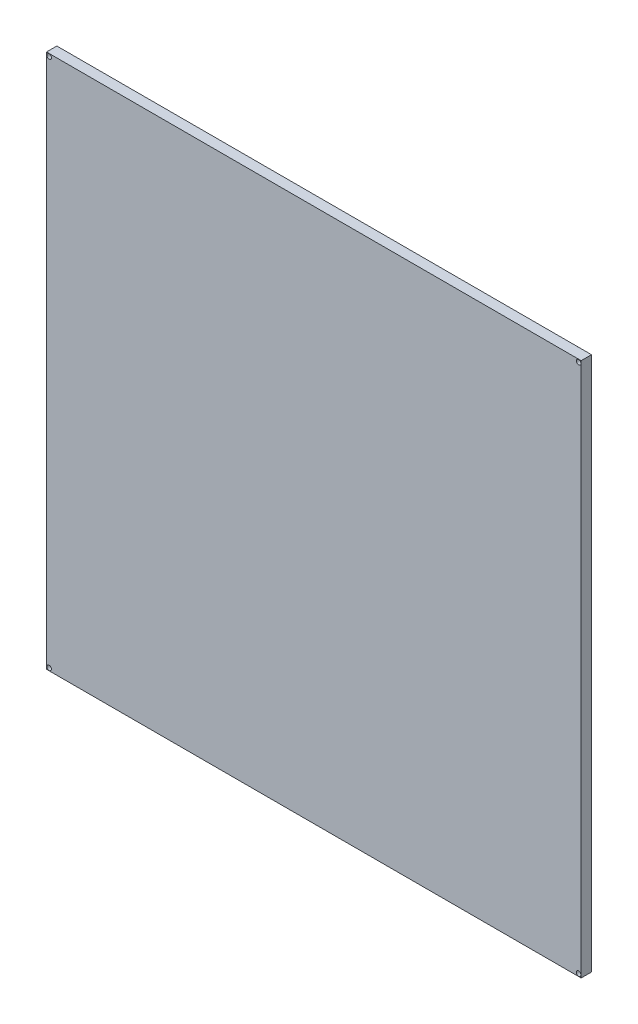
ISO-10303-21;
HEADER;
FILE_DESCRIPTION(('STEP AP214'),'2;1');
FILE_NAME('part.step','',(''),(''),'','','');
FILE_SCHEMA(('AUTOMOTIVE_DESIGN { 1 0 10303 214 1 1 1 1 }'));
ENDSEC;
DATA;
#1=APPLICATION_CONTEXT('core data for automotive mechanical design processes');
#2=APPLICATION_PROTOCOL_DEFINITION('international standard','automotive_design',2000,#1);
#3=PRODUCT_CONTEXT('',#1,'mechanical');
#4=PRODUCT('Part','Part','',(#3));
#5=PRODUCT_RELATED_PRODUCT_CATEGORY('part','',(#4));
#6=PRODUCT_DEFINITION_FORMATION('','',#4);
#7=PRODUCT_DEFINITION_CONTEXT('part definition',#1,'design');
#8=PRODUCT_DEFINITION('design','',#6,#7);
#9=PRODUCT_DEFINITION_SHAPE('','',#8);
#10=(LENGTH_UNIT() NAMED_UNIT(*) SI_UNIT(.MILLI.,.METRE.));
#11=(NAMED_UNIT(*) PLANE_ANGLE_UNIT() SI_UNIT($,.RADIAN.));
#12=(NAMED_UNIT(*) SI_UNIT($,.STERADIAN.) SOLID_ANGLE_UNIT());
#13=UNCERTAINTY_MEASURE_WITH_UNIT(LENGTH_MEASURE(1.E-05),#10,'distance_accuracy_value','');
#14=(GEOMETRIC_REPRESENTATION_CONTEXT(3) GLOBAL_UNCERTAINTY_ASSIGNED_CONTEXT((#13)) GLOBAL_UNIT_ASSIGNED_CONTEXT((#10,
#11,#12)) REPRESENTATION_CONTEXT('',''));
#15=CARTESIAN_POINT('',(0.,0.,0.));
#16=DIRECTION('',(0.,0.,1.));
#17=DIRECTION('',(1.,0.,0.));
#18=AXIS2_PLACEMENT_3D('',#15,#16,#17);
#19=CARTESIAN_POINT('',(-13.1481959272974,24.0496828162428,1.));
#20=DIRECTION('',(1.,0.,0.));
#21=DIRECTION('',(0.,1.,0.));
#22=AXIS2_PLACEMENT_3D('',#19,#20,#21);
#23=PLANE('',#22);
#24=DIRECTION('',(0.,-1.,0.));
#25=VECTOR('',#24,1.);
#26=CARTESIAN_POINT('',(-13.1481959272974,24.0496828162428,0.));
#27=LINE('',#26,#25);
#28=CARTESIAN_POINT('',(-13.1481959272974,24.0496828162428,0.));
#29=VERTEX_POINT('',#28);
#30=CARTESIAN_POINT('',(-13.1481959272974,-27.7503171837572,0.));
#31=VERTEX_POINT('',#30);
#32=EDGE_CURVE('E109',#29,#31,#27,.T.);
#33=ORIENTED_EDGE('',*,*,#32,.T.);
#34=DIRECTION('',(0.,0.,-1.));
#35=VECTOR('',#34,1.);
#36=CARTESIAN_POINT('',(-13.1481959272974,-27.7503171837572,1.));
#37=LINE('',#36,#35);
#38=CARTESIAN_POINT('',(-13.1481959272974,-27.7503171837572,1.));
#39=VERTEX_POINT('',#38);
#40=EDGE_CURVE('E11',#39,#31,#37,.T.);
#41=ORIENTED_EDGE('',*,*,#40,.F.);
#42=DIRECTION('',(0.,-1.,0.));
#43=VECTOR('',#42,1.);
#44=CARTESIAN_POINT('',(-13.1481959272974,24.0496828162428,1.));
#45=LINE('',#44,#43);
#46=CARTESIAN_POINT('',(-13.1481959272974,24.0496828162428,1.));
#47=VERTEX_POINT('',#46);
#48=EDGE_CURVE('E93',#47,#39,#45,.T.);
#49=ORIENTED_EDGE('',*,*,#48,.F.);
#50=DIRECTION('',(0.,0.,-1.));
#51=VECTOR('',#50,1.);
#52=CARTESIAN_POINT('',(-13.1481959272974,24.0496828162428,1.));
#53=LINE('',#52,#51);
#54=EDGE_CURVE('E105',#47,#29,#53,.T.);
#55=ORIENTED_EDGE('',*,*,#54,.T.);
#56=EDGE_LOOP('',(#33,#41,#49,#55));
#57=FACE_BOUND('',#56,.T.);
#58=ADVANCED_FACE('F41',(#57),#23,.F.);
#59=CARTESIAN_POINT('',(-13.1481959272974,-27.7503171837572,1.));
#60=DIRECTION('',(0.,1.,0.));
#61=DIRECTION('',(-1.,0.,0.));
#62=AXIS2_PLACEMENT_3D('',#59,#60,#61);
#63=PLANE('',#62);
#64=DIRECTION('',(1.,0.,0.));
#65=VECTOR('',#64,1.);
#66=CARTESIAN_POINT('',(-13.1481959272974,-27.7503171837572,0.));
#67=LINE('',#66,#65);
#68=CARTESIAN_POINT('',(38.6518040727026,-27.7503171837572,0.));
#69=VERTEX_POINT('',#68);
#70=EDGE_CURVE('E98',#31,#69,#67,.T.);
#71=ORIENTED_EDGE('',*,*,#70,.T.);
#72=DIRECTION('',(0.,0.,-1.));
#73=VECTOR('',#72,1.);
#74=CARTESIAN_POINT('',(38.6518040727026,-27.7503171837572,1.));
#75=LINE('',#74,#73);
#76=CARTESIAN_POINT('',(38.6518040727026,-27.7503171837572,1.));
#77=VERTEX_POINT('',#76);
#78=EDGE_CURVE('E50',#77,#69,#75,.T.);
#79=ORIENTED_EDGE('',*,*,#78,.F.);
#80=DIRECTION('',(1.,0.,0.));
#81=VECTOR('',#80,1.);
#82=CARTESIAN_POINT('',(-13.1481959272974,-27.7503171837572,1.));
#83=LINE('',#82,#81);
#84=EDGE_CURVE('E88',#39,#77,#83,.T.);
#85=ORIENTED_EDGE('',*,*,#84,.F.);
#86=ORIENTED_EDGE('',*,*,#40,.T.);
#87=EDGE_LOOP('',(#71,#79,#85,#86));
#88=FACE_BOUND('',#87,.T.);
#89=ADVANCED_FACE('F97',(#88),#63,.F.);
#90=CARTESIAN_POINT('',(38.6518040727026,24.0496828162428,1.));
#91=DIRECTION('',(-1.,0.,0.));
#92=DIRECTION('',(0.,0.,1.));
#93=AXIS2_PLACEMENT_3D('',#90,#91,#92);
#94=PLANE('',#93);
#95=DIRECTION('',(0.,1.,0.));
#96=VECTOR('',#95,1.);
#97=CARTESIAN_POINT('',(38.6518040727026,24.0496828162428,0.));
#98=LINE('',#97,#96);
#99=CARTESIAN_POINT('',(38.6518040727026,24.0496828162428,0.));
#100=VERTEX_POINT('',#99);
#101=EDGE_CURVE('E75',#69,#100,#98,.T.);
#102=ORIENTED_EDGE('',*,*,#101,.T.);
#103=DIRECTION('',(0.,0.,-1.));
#104=VECTOR('',#103,1.);
#105=CARTESIAN_POINT('',(38.6518040727026,24.0496828162428,1.));
#106=LINE('',#105,#104);
#107=CARTESIAN_POINT('',(38.6518040727026,24.0496828162428,1.));
#108=VERTEX_POINT('',#107);
#109=EDGE_CURVE('E100',#108,#100,#106,.T.);
#110=ORIENTED_EDGE('',*,*,#109,.F.);
#111=DIRECTION('',(0.,1.,0.));
#112=VECTOR('',#111,1.);
#113=CARTESIAN_POINT('',(38.6518040727026,24.0496828162428,1.));
#114=LINE('',#113,#112);
#115=EDGE_CURVE('E91',#77,#108,#114,.T.);
#116=ORIENTED_EDGE('',*,*,#115,.F.);
#117=ORIENTED_EDGE('',*,*,#78,.T.);
#118=EDGE_LOOP('',(#102,#110,#116,#117));
#119=FACE_BOUND('',#118,.T.);
#120=ADVANCED_FACE('F101',(#119),#94,.F.);
#121=CARTESIAN_POINT('',(-13.1481959272974,24.0496828162428,1.));
#122=DIRECTION('',(0.,-1.,0.));
#123=DIRECTION('',(0.,0.,-1.));
#124=AXIS2_PLACEMENT_3D('',#121,#122,#123);
#125=PLANE('',#124);
#126=DIRECTION('',(-1.,0.,0.));
#127=VECTOR('',#126,1.);
#128=CARTESIAN_POINT('',(-13.1481959272974,24.0496828162428,0.));
#129=LINE('',#128,#127);
#130=EDGE_CURVE('E81',#100,#29,#129,.T.);
#131=ORIENTED_EDGE('',*,*,#130,.T.);
#132=ORIENTED_EDGE('',*,*,#54,.F.);
#133=DIRECTION('',(-1.,0.,0.));
#134=VECTOR('',#133,1.);
#135=CARTESIAN_POINT('',(-13.1481959272974,24.0496828162428,1.));
#136=LINE('',#135,#134);
#137=EDGE_CURVE('E58',#108,#47,#136,.T.);
#138=ORIENTED_EDGE('',*,*,#137,.F.);
#139=ORIENTED_EDGE('',*,*,#109,.T.);
#140=EDGE_LOOP('',(#131,#132,#138,#139));
#141=FACE_BOUND('',#140,.T.);
#142=ADVANCED_FACE('F123',(#141),#125,.F.);
#143=CARTESIAN_POINT('',(0.,0.,1.));
#144=DIRECTION('',(0.,0.,1.));
#145=DIRECTION('',(1.,0.,0.));
#146=AXIS2_PLACEMENT_3D('',#143,#144,#145);
#147=PLANE('',#146);
#148=CARTESIAN_POINT('',(-12.8943568898897,23.80096777771,1.));
#149=DIRECTION('',(0.,0.,-1.));
#150=DIRECTION('',(1.,0.,0.));
#151=AXIS2_PLACEMENT_3D('',#148,#149,#150);
#152=CIRCLE('',#151,0.225000000000001);
#153=CARTESIAN_POINT('',(-12.6693568898897,23.80096777771,1.));
#154=VERTEX_POINT('',#153);
#155=EDGE_CURVE('E142',#154,#154,#152,.T.);
#156=ORIENTED_EDGE('',*,*,#155,.T.);
#157=EDGE_LOOP('',(#156));
#158=FACE_BOUND('',#157,.T.);
#159=CARTESIAN_POINT('',(-12.8943568898897,-27.5016021452244,1.));
#160=DIRECTION('',(0.,0.,-1.));
#161=DIRECTION('',(-1.,0.,0.));
#162=AXIS2_PLACEMENT_3D('',#159,#160,#161);
#163=CIRCLE('',#162,0.225000000000001);
#164=CARTESIAN_POINT('',(-13.1193568898897,-27.5016021452244,1.));
#165=VERTEX_POINT('',#164);
#166=EDGE_CURVE('E150',#165,#165,#163,.T.);
#167=ORIENTED_EDGE('',*,*,#166,.T.);
#168=EDGE_LOOP('',(#167));
#169=FACE_BOUND('',#168,.T.);
#170=CARTESIAN_POINT('',(38.4047853486749,-27.5016021452244,1.));
#171=DIRECTION('',(0.,0.,-1.));
#172=DIRECTION('',(1.,0.,0.));
#173=AXIS2_PLACEMENT_3D('',#170,#171,#172);
#174=CIRCLE('',#173,0.225000000000001);
#175=CARTESIAN_POINT('',(38.6297853486749,-27.5016021452244,1.));
#176=VERTEX_POINT('',#175);
#177=EDGE_CURVE('E134',#176,#176,#174,.T.);
#178=ORIENTED_EDGE('',*,*,#177,.T.);
#179=EDGE_LOOP('',(#178));
#180=FACE_BOUND('',#179,.T.);
#181=CARTESIAN_POINT('',(38.4047853486749,23.80096777771,1.));
#182=DIRECTION('',(0.,0.,-1.));
#183=DIRECTION('',(-1.,0.,0.));
#184=AXIS2_PLACEMENT_3D('',#181,#182,#183);
#185=CIRCLE('',#184,0.225000000000001);
#186=CARTESIAN_POINT('',(38.1797853486749,23.80096777771,1.));
#187=VERTEX_POINT('',#186);
#188=EDGE_CURVE('E113',#187,#187,#185,.T.);
#189=ORIENTED_EDGE('',*,*,#188,.T.);
#190=EDGE_LOOP('',(#189));
#191=FACE_BOUND('',#190,.T.);
#192=ORIENTED_EDGE('',*,*,#48,.T.);
#193=ORIENTED_EDGE('',*,*,#84,.T.);
#194=ORIENTED_EDGE('',*,*,#115,.T.);
#195=ORIENTED_EDGE('',*,*,#137,.T.);
#196=EDGE_LOOP('',(#192,#193,#194,#195));
#197=FACE_BOUND('',#196,.T.);
#198=ADVANCED_FACE('F89',(#158,#169,#180,#191,#197),#147,.T.);
#199=CARTESIAN_POINT('',(0.,0.,0.));
#200=DIRECTION('',(0.,0.,1.));
#201=DIRECTION('',(1.,0.,0.));
#202=AXIS2_PLACEMENT_3D('',#199,#200,#201);
#203=PLANE('',#202);
#204=CARTESIAN_POINT('',(-12.8943568898897,23.80096777771,0.));
#205=DIRECTION('',(0.,0.,-1.));
#206=DIRECTION('',(1.,0.,0.));
#207=AXIS2_PLACEMENT_3D('',#204,#205,#206);
#208=CIRCLE('',#207,0.225000000000001);
#209=CARTESIAN_POINT('',(-12.6693568898897,23.80096777771,0.));
#210=VERTEX_POINT('',#209);
#211=EDGE_CURVE('E138',#210,#210,#208,.T.);
#212=ORIENTED_EDGE('',*,*,#211,.F.);
#213=EDGE_LOOP('',(#212));
#214=FACE_BOUND('',#213,.T.);
#215=CARTESIAN_POINT('',(-12.8943568898897,-27.5016021452244,0.));
#216=DIRECTION('',(0.,0.,-1.));
#217=DIRECTION('',(-1.,0.,0.));
#218=AXIS2_PLACEMENT_3D('',#215,#216,#217);
#219=CIRCLE('',#218,0.225000000000001);
#220=CARTESIAN_POINT('',(-13.1193568898897,-27.5016021452244,0.));
#221=VERTEX_POINT('',#220);
#222=EDGE_CURVE('E146',#221,#221,#219,.T.);
#223=ORIENTED_EDGE('',*,*,#222,.F.);
#224=EDGE_LOOP('',(#223));
#225=FACE_BOUND('',#224,.T.);
#226=CARTESIAN_POINT('',(38.4047853486749,-27.5016021452244,0.));
#227=DIRECTION('',(0.,0.,-1.));
#228=DIRECTION('',(1.,0.,0.));
#229=AXIS2_PLACEMENT_3D('',#226,#227,#228);
#230=CIRCLE('',#229,0.225000000000001);
#231=CARTESIAN_POINT('',(38.6297853486749,-27.5016021452244,0.));
#232=VERTEX_POINT('',#231);
#233=EDGE_CURVE('E154',#232,#232,#230,.T.);
#234=ORIENTED_EDGE('',*,*,#233,.F.);
#235=EDGE_LOOP('',(#234));
#236=FACE_BOUND('',#235,.T.);
#237=CARTESIAN_POINT('',(38.4047853486749,23.80096777771,0.));
#238=DIRECTION('',(0.,0.,-1.));
#239=DIRECTION('',(-1.,0.,0.));
#240=AXIS2_PLACEMENT_3D('',#237,#238,#239);
#241=CIRCLE('',#240,0.225000000000001);
#242=CARTESIAN_POINT('',(38.1797853486749,23.80096777771,0.));
#243=VERTEX_POINT('',#242);
#244=EDGE_CURVE('E130',#243,#243,#241,.T.);
#245=ORIENTED_EDGE('',*,*,#244,.F.);
#246=EDGE_LOOP('',(#245));
#247=FACE_BOUND('',#246,.T.);
#248=ORIENTED_EDGE('',*,*,#32,.F.);
#249=ORIENTED_EDGE('',*,*,#130,.F.);
#250=ORIENTED_EDGE('',*,*,#101,.F.);
#251=ORIENTED_EDGE('',*,*,#70,.F.);
#252=EDGE_LOOP('',(#248,#249,#250,#251));
#253=FACE_BOUND('',#252,.T.);
#254=ADVANCED_FACE('F126',(#214,#225,#236,#247,#253),#203,.F.);
#255=CARTESIAN_POINT('',(38.4047853486749,23.80096777771,1.));
#256=DIRECTION('',(0.,0.,-1.));
#257=DIRECTION('',(-1.,0.,0.));
#258=AXIS2_PLACEMENT_3D('',#255,#256,#257);
#259=CYLINDRICAL_SURFACE('',#258,0.225000000000001);
#260=ORIENTED_EDGE('',*,*,#188,.F.);
#261=EDGE_LOOP('',(#260));
#262=FACE_BOUND('',#261,.T.);
#263=ORIENTED_EDGE('',*,*,#244,.T.);
#264=EDGE_LOOP('',(#263));
#265=FACE_BOUND('',#264,.T.);
#266=ADVANCED_FACE('F168',(#262,#265),#259,.F.);
#267=CARTESIAN_POINT('',(38.4047853486749,-27.5016021452244,1.));
#268=DIRECTION('',(0.,0.,-1.));
#269=DIRECTION('',(-1.,0.,0.));
#270=AXIS2_PLACEMENT_3D('',#267,#268,#269);
#271=CYLINDRICAL_SURFACE('',#270,0.225000000000001);
#272=ORIENTED_EDGE('',*,*,#177,.F.);
#273=EDGE_LOOP('',(#272));
#274=FACE_BOUND('',#273,.T.);
#275=ORIENTED_EDGE('',*,*,#233,.T.);
#276=EDGE_LOOP('',(#275));
#277=FACE_BOUND('',#276,.T.);
#278=ADVANCED_FACE('F164',(#274,#277),#271,.F.);
#279=CARTESIAN_POINT('',(-12.8943568898897,-27.5016021452244,1.));
#280=DIRECTION('',(0.,0.,-1.));
#281=DIRECTION('',(-1.,0.,0.));
#282=AXIS2_PLACEMENT_3D('',#279,#280,#281);
#283=CYLINDRICAL_SURFACE('',#282,0.225000000000001);
#284=ORIENTED_EDGE('',*,*,#166,.F.);
#285=EDGE_LOOP('',(#284));
#286=FACE_BOUND('',#285,.T.);
#287=ORIENTED_EDGE('',*,*,#222,.T.);
#288=EDGE_LOOP('',(#287));
#289=FACE_BOUND('',#288,.T.);
#290=ADVANCED_FACE('F167',(#286,#289),#283,.F.);
#291=CARTESIAN_POINT('',(-12.8943568898897,23.80096777771,1.));
#292=DIRECTION('',(0.,0.,-1.));
#293=DIRECTION('',(-1.,0.,0.));
#294=AXIS2_PLACEMENT_3D('',#291,#292,#293);
#295=CYLINDRICAL_SURFACE('',#294,0.225000000000001);
#296=ORIENTED_EDGE('',*,*,#155,.F.);
#297=EDGE_LOOP('',(#296));
#298=FACE_BOUND('',#297,.T.);
#299=ORIENTED_EDGE('',*,*,#211,.T.);
#300=EDGE_LOOP('',(#299));
#301=FACE_BOUND('',#300,.T.);
#302=ADVANCED_FACE('F206',(#298,#301),#295,.F.);
#303=CLOSED_SHELL('',(#58,#89,#120,#142,#198,#254,#266,#278,#290,#302));
#304=MANIFOLD_SOLID_BREP('B2',#303);
#305=ADVANCED_BREP_SHAPE_REPRESENTATION('',(#18,#304),#14);
#306=SHAPE_DEFINITION_REPRESENTATION(#9,#305);
ENDSEC;
END-ISO-10303-21;
